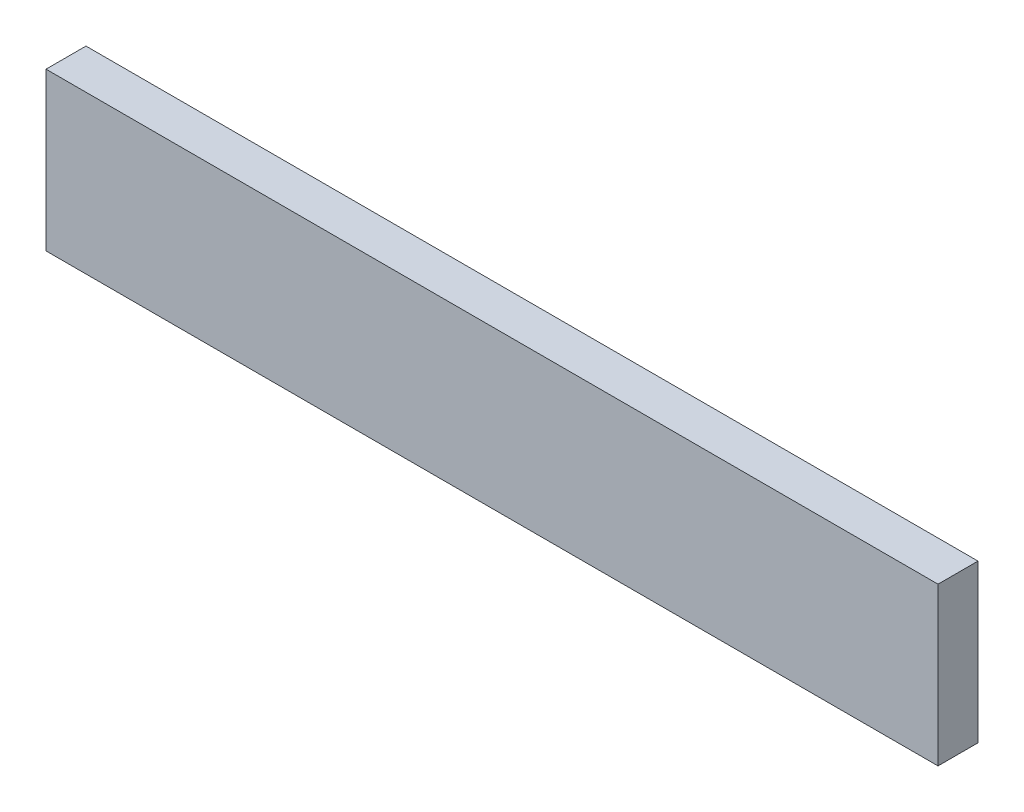
ISO-10303-21;
HEADER;
FILE_DESCRIPTION(('STEP AP214'),'2;1');
FILE_NAME('part.step','',(''),(''),'','','');
FILE_SCHEMA(('AUTOMOTIVE_DESIGN { 1 0 10303 214 1 1 1 1 }'));
ENDSEC;
DATA;
#1=APPLICATION_CONTEXT('core data for automotive mechanical design processes');
#2=APPLICATION_PROTOCOL_DEFINITION('international standard','automotive_design',2000,#1);
#3=PRODUCT_CONTEXT('',#1,'mechanical');
#4=PRODUCT('Part','Part','',(#3));
#5=PRODUCT_RELATED_PRODUCT_CATEGORY('part','',(#4));
#6=PRODUCT_DEFINITION_FORMATION('','',#4);
#7=PRODUCT_DEFINITION_CONTEXT('part definition',#1,'design');
#8=PRODUCT_DEFINITION('design','',#6,#7);
#9=PRODUCT_DEFINITION_SHAPE('','',#8);
#10=(LENGTH_UNIT() NAMED_UNIT(*) SI_UNIT(.MILLI.,.METRE.));
#11=(NAMED_UNIT(*) PLANE_ANGLE_UNIT() SI_UNIT($,.RADIAN.));
#12=(NAMED_UNIT(*) SI_UNIT($,.STERADIAN.) SOLID_ANGLE_UNIT());
#13=UNCERTAINTY_MEASURE_WITH_UNIT(LENGTH_MEASURE(1.E-05),#10,'distance_accuracy_value','');
#14=(GEOMETRIC_REPRESENTATION_CONTEXT(3) GLOBAL_UNCERTAINTY_ASSIGNED_CONTEXT((#13)) GLOBAL_UNIT_ASSIGNED_CONTEXT((#10,
#11,#12)) REPRESENTATION_CONTEXT('',''));
#15=CARTESIAN_POINT('',(0.,0.,0.));
#16=DIRECTION('',(0.,0.,1.));
#17=DIRECTION('',(1.,0.,0.));
#18=AXIS2_PLACEMENT_3D('',#15,#16,#17);
#19=CARTESIAN_POINT('',(-34.,6.,3.048));
#20=DIRECTION('',(1.,0.,0.));
#21=DIRECTION('',(0.,0.,-1.));
#22=AXIS2_PLACEMENT_3D('',#19,#20,#21);
#23=PLANE('',#22);
#24=DIRECTION('',(0.,-1.,0.));
#25=VECTOR('',#24,1.);
#26=CARTESIAN_POINT('',(-34.,6.,0.));
#27=LINE('',#26,#25);
#28=CARTESIAN_POINT('',(-34.,6.,0.));
#29=VERTEX_POINT('',#28);
#30=CARTESIAN_POINT('',(-34.,-6.,0.));
#31=VERTEX_POINT('',#30);
#32=EDGE_CURVE('E96',#29,#31,#27,.T.);
#33=ORIENTED_EDGE('',*,*,#32,.T.);
#34=DIRECTION('',(0.,0.,-1.));
#35=VECTOR('',#34,1.);
#36=CARTESIAN_POINT('',(-34.,-6.,3.048));
#37=LINE('',#36,#35);
#38=CARTESIAN_POINT('',(-34.,-6.,3.048));
#39=VERTEX_POINT('',#38);
#40=EDGE_CURVE('E11',#39,#31,#37,.T.);
#41=ORIENTED_EDGE('',*,*,#40,.F.);
#42=DIRECTION('',(0.,-1.,0.));
#43=VECTOR('',#42,1.);
#44=CARTESIAN_POINT('',(-34.,6.,3.048));
#45=LINE('',#44,#43);
#46=CARTESIAN_POINT('',(-34.,6.,3.048));
#47=VERTEX_POINT('',#46);
#48=EDGE_CURVE('E84',#47,#39,#45,.T.);
#49=ORIENTED_EDGE('',*,*,#48,.F.);
#50=DIRECTION('',(0.,0.,-1.));
#51=VECTOR('',#50,1.);
#52=CARTESIAN_POINT('',(-34.,6.,3.048));
#53=LINE('',#52,#51);
#54=EDGE_CURVE('E92',#47,#29,#53,.T.);
#55=ORIENTED_EDGE('',*,*,#54,.T.);
#56=EDGE_LOOP('',(#33,#41,#49,#55));
#57=FACE_BOUND('',#56,.T.);
#58=ADVANCED_FACE('F33',(#57),#23,.F.);
#59=CARTESIAN_POINT('',(34.,-5.99999999999999,3.048));
#60=DIRECTION('',(0.,1.,0.));
#61=DIRECTION('',(-1.,0.,0.));
#62=AXIS2_PLACEMENT_3D('',#59,#60,#61);
#63=PLANE('',#62);
#64=DIRECTION('',(1.,0.,0.));
#65=VECTOR('',#64,1.);
#66=CARTESIAN_POINT('',(34.,-5.99999999999999,0.));
#67=LINE('',#66,#65);
#68=CARTESIAN_POINT('',(34.,-5.99999999999999,0.));
#69=VERTEX_POINT('',#68);
#70=EDGE_CURVE('E88',#31,#69,#67,.T.);
#71=ORIENTED_EDGE('',*,*,#70,.T.);
#72=DIRECTION('',(0.,0.,-1.));
#73=VECTOR('',#72,1.);
#74=CARTESIAN_POINT('',(34.,-5.99999999999999,3.048));
#75=LINE('',#74,#73);
#76=CARTESIAN_POINT('',(34.,-5.99999999999999,3.048));
#77=VERTEX_POINT('',#76);
#78=EDGE_CURVE('E41',#77,#69,#75,.T.);
#79=ORIENTED_EDGE('',*,*,#78,.F.);
#80=DIRECTION('',(1.,0.,0.));
#81=VECTOR('',#80,1.);
#82=CARTESIAN_POINT('',(34.,-5.99999999999999,3.048));
#83=LINE('',#82,#81);
#84=EDGE_CURVE('E79',#39,#77,#83,.T.);
#85=ORIENTED_EDGE('',*,*,#84,.F.);
#86=ORIENTED_EDGE('',*,*,#40,.T.);
#87=EDGE_LOOP('',(#71,#79,#85,#86));
#88=FACE_BOUND('',#87,.T.);
#89=ADVANCED_FACE('F87',(#88),#63,.F.);
#90=CARTESIAN_POINT('',(34.,6.00000000000001,3.048));
#91=DIRECTION('',(-1.,0.,0.));
#92=DIRECTION('',(0.,0.,1.));
#93=AXIS2_PLACEMENT_3D('',#90,#91,#92);
#94=PLANE('',#93);
#95=DIRECTION('',(0.,1.,0.));
#96=VECTOR('',#95,1.);
#97=CARTESIAN_POINT('',(34.,6.00000000000001,0.));
#98=LINE('',#97,#96);
#99=CARTESIAN_POINT('',(34.,6.00000000000001,0.));
#100=VERTEX_POINT('',#99);
#101=EDGE_CURVE('E66',#69,#100,#98,.T.);
#102=ORIENTED_EDGE('',*,*,#101,.T.);
#103=DIRECTION('',(0.,0.,-1.));
#104=VECTOR('',#103,1.);
#105=CARTESIAN_POINT('',(34.,6.00000000000001,3.048));
#106=LINE('',#105,#104);
#107=CARTESIAN_POINT('',(34.,6.00000000000001,3.048));
#108=VERTEX_POINT('',#107);
#109=EDGE_CURVE('E89',#108,#100,#106,.T.);
#110=ORIENTED_EDGE('',*,*,#109,.F.);
#111=DIRECTION('',(0.,1.,0.));
#112=VECTOR('',#111,1.);
#113=CARTESIAN_POINT('',(34.,6.00000000000001,3.048));
#114=LINE('',#113,#112);
#115=EDGE_CURVE('E82',#77,#108,#114,.T.);
#116=ORIENTED_EDGE('',*,*,#115,.F.);
#117=ORIENTED_EDGE('',*,*,#78,.T.);
#118=EDGE_LOOP('',(#102,#110,#116,#117));
#119=FACE_BOUND('',#118,.T.);
#120=ADVANCED_FACE('F90',(#119),#94,.F.);
#121=CARTESIAN_POINT('',(34.,6.00000000000001,3.048));
#122=DIRECTION('',(0.,-1.,0.));
#123=DIRECTION('',(1.,0.,0.));
#124=AXIS2_PLACEMENT_3D('',#121,#122,#123);
#125=PLANE('',#124);
#126=DIRECTION('',(-1.,0.,0.));
#127=VECTOR('',#126,1.);
#128=CARTESIAN_POINT('',(34.,6.00000000000001,0.));
#129=LINE('',#128,#127);
#130=EDGE_CURVE('E72',#100,#29,#129,.T.);
#131=ORIENTED_EDGE('',*,*,#130,.T.);
#132=ORIENTED_EDGE('',*,*,#54,.F.);
#133=DIRECTION('',(-1.,0.,0.));
#134=VECTOR('',#133,1.);
#135=CARTESIAN_POINT('',(34.,6.00000000000001,3.048));
#136=LINE('',#135,#134);
#137=EDGE_CURVE('E49',#108,#47,#136,.T.);
#138=ORIENTED_EDGE('',*,*,#137,.F.);
#139=ORIENTED_EDGE('',*,*,#109,.T.);
#140=EDGE_LOOP('',(#131,#132,#138,#139));
#141=FACE_BOUND('',#140,.T.);
#142=ADVANCED_FACE('F103',(#141),#125,.F.);
#143=CARTESIAN_POINT('',(0.,0.,3.048));
#144=DIRECTION('',(0.,0.,-1.));
#145=DIRECTION('',(-1.,0.,0.));
#146=AXIS2_PLACEMENT_3D('',#143,#144,#145);
#147=PLANE('',#146);
#148=ORIENTED_EDGE('',*,*,#48,.T.);
#149=ORIENTED_EDGE('',*,*,#84,.T.);
#150=ORIENTED_EDGE('',*,*,#115,.T.);
#151=ORIENTED_EDGE('',*,*,#137,.T.);
#152=EDGE_LOOP('',(#148,#149,#150,#151));
#153=FACE_BOUND('',#152,.T.);
#154=ADVANCED_FACE('F80',(#153),#147,.F.);
#155=CARTESIAN_POINT('',(0.,0.,0.));
#156=DIRECTION('',(0.,0.,-1.));
#157=DIRECTION('',(-1.,0.,0.));
#158=AXIS2_PLACEMENT_3D('',#155,#156,#157);
#159=PLANE('',#158);
#160=ORIENTED_EDGE('',*,*,#32,.F.);
#161=ORIENTED_EDGE('',*,*,#130,.F.);
#162=ORIENTED_EDGE('',*,*,#101,.F.);
#163=ORIENTED_EDGE('',*,*,#70,.F.);
#164=EDGE_LOOP('',(#160,#161,#162,#163));
#165=FACE_BOUND('',#164,.T.);
#166=ADVANCED_FACE('F106',(#165),#159,.T.);
#167=CLOSED_SHELL('',(#58,#89,#120,#142,#154,#166));
#168=MANIFOLD_SOLID_BREP('B2',#167);
#169=ADVANCED_BREP_SHAPE_REPRESENTATION('',(#18,#168),#14);
#170=SHAPE_DEFINITION_REPRESENTATION(#9,#169);
ENDSEC;
END-ISO-10303-21;
